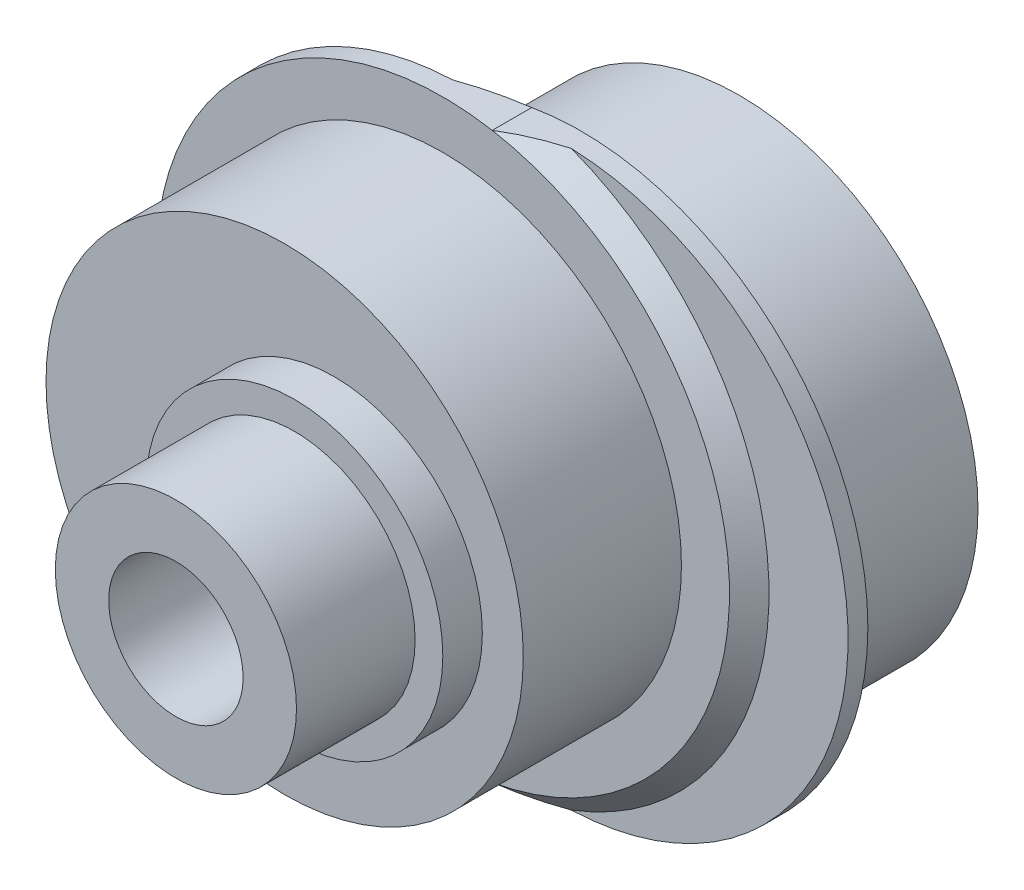
ISO-10303-21;
HEADER;
FILE_DESCRIPTION(('STEP AP214'),'2;1');
FILE_NAME('part.step','',(''),(''),'','','');
FILE_SCHEMA(('AUTOMOTIVE_DESIGN { 1 0 10303 214 1 1 1 1 }'));
ENDSEC;
DATA;
#1=APPLICATION_CONTEXT('core data for automotive mechanical design processes');
#2=APPLICATION_PROTOCOL_DEFINITION('international standard','automotive_design',2000,#1);
#3=PRODUCT_CONTEXT('',#1,'mechanical');
#4=PRODUCT('Part','Part','',(#3));
#5=PRODUCT_RELATED_PRODUCT_CATEGORY('part','',(#4));
#6=PRODUCT_DEFINITION_FORMATION('','',#4);
#7=PRODUCT_DEFINITION_CONTEXT('part definition',#1,'design');
#8=PRODUCT_DEFINITION('design','',#6,#7);
#9=PRODUCT_DEFINITION_SHAPE('','',#8);
#10=(LENGTH_UNIT() NAMED_UNIT(*) SI_UNIT(.MILLI.,.METRE.));
#11=(NAMED_UNIT(*) PLANE_ANGLE_UNIT() SI_UNIT($,.RADIAN.));
#12=(NAMED_UNIT(*) SI_UNIT($,.STERADIAN.) SOLID_ANGLE_UNIT());
#13=UNCERTAINTY_MEASURE_WITH_UNIT(LENGTH_MEASURE(1.E-05),#10,'distance_accuracy_value','');
#14=(GEOMETRIC_REPRESENTATION_CONTEXT(3) GLOBAL_UNCERTAINTY_ASSIGNED_CONTEXT((#13)) GLOBAL_UNIT_ASSIGNED_CONTEXT((#10,
#11,#12)) REPRESENTATION_CONTEXT('',''));
#15=CARTESIAN_POINT('',(0.,0.,0.));
#16=DIRECTION('',(0.,0.,1.));
#17=DIRECTION('',(1.,0.,0.));
#18=AXIS2_PLACEMENT_3D('',#15,#16,#17);
#19=CARTESIAN_POINT('',(0.,0.,5.));
#20=DIRECTION('',(0.,0.,1.));
#21=DIRECTION('',(1.,0.,0.));
#22=AXIS2_PLACEMENT_3D('',#19,#20,#21);
#23=PLANE('',#22);
#24=CARTESIAN_POINT('',(-1.25,0.,5.));
#25=DIRECTION('',(0.,0.,1.));
#26=DIRECTION('',(1.,0.,0.));
#27=AXIS2_PLACEMENT_3D('',#24,#25,#26);
#28=CIRCLE('',#27,6.035);
#29=CARTESIAN_POINT('',(4.785,0.,5.));
#30=VERTEX_POINT('',#29);
#31=EDGE_CURVE('E285',#30,#30,#28,.T.);
#32=ORIENTED_EDGE('',*,*,#31,.F.);
#33=EDGE_LOOP('',(#32));
#34=FACE_BOUND('',#33,.T.);
#35=CARTESIAN_POINT('',(-1.25,0.,5.));
#36=DIRECTION('',(0.,0.,1.));
#37=DIRECTION('',(1.,0.,0.));
#38=AXIS2_PLACEMENT_3D('',#35,#36,#37);
#39=CIRCLE('',#38,7.25);
#40=CARTESIAN_POINT('',(0.,-7.14142842854285,5.));
#41=VERTEX_POINT('',#40);
#42=CARTESIAN_POINT('',(0.,7.14142842854285,5.));
#43=VERTEX_POINT('',#42);
#44=EDGE_CURVE('E512',#41,#43,#39,.F.);
#45=ORIENTED_EDGE('',*,*,#44,.F.);
#46=EDGE_CURVE('E508',#43,#41,#39,.F.);
#47=ORIENTED_EDGE('',*,*,#46,.F.);
#48=EDGE_LOOP('',(#45,#47));
#49=FACE_BOUND('',#48,.T.);
#50=ADVANCED_FACE('F51',(#34,#49),#23,.T.);
#51=CARTESIAN_POINT('',(1.25,0.,5.002));
#52=DIRECTION('',(0.,0.,-1.));
#53=DIRECTION('',(-1.,0.,0.));
#54=AXIS2_PLACEMENT_3D('',#51,#52,#53);
#55=CYLINDRICAL_SURFACE('',#54,7.25);
#56=DIRECTION('',(0.,0.,-1.));
#57=VECTOR('',#56,1.);
#58=CARTESIAN_POINT('',(0.,-7.14142842854286,4.5));
#59=LINE('',#58,#57);
#60=CARTESIAN_POINT('',(0.,-7.14142842854285,4.));
#61=VERTEX_POINT('',#60);
#62=EDGE_CURVE('E435',#61,#41,#59,.F.);
#63=ORIENTED_EDGE('',*,*,#62,.F.);
#64=CARTESIAN_POINT('',(1.25,0.,4.));
#65=DIRECTION('',(0.,0.,1.));
#66=DIRECTION('',(1.,0.,0.));
#67=AXIS2_PLACEMENT_3D('',#64,#65,#66);
#68=CIRCLE('',#67,7.25);
#69=CARTESIAN_POINT('',(0.,7.14142842854285,4.));
#70=VERTEX_POINT('',#69);
#71=EDGE_CURVE('E433',#61,#70,#68,.T.);
#72=ORIENTED_EDGE('',*,*,#71,.T.);
#73=DIRECTION('',(0.,0.,-1.));
#74=VECTOR('',#73,1.);
#75=CARTESIAN_POINT('',(0.,7.14142842854285,5.));
#76=LINE('',#75,#74);
#77=EDGE_CURVE('E434',#43,#70,#76,.T.);
#78=ORIENTED_EDGE('',*,*,#77,.F.);
#79=CARTESIAN_POINT('',(0.,7.14142842854285,5.));
#80=CARTESIAN_POINT('',(0.123509212670828,7.16304891105433,4.95740968363325));
#81=CARTESIAN_POINT('',(0.247635722677284,7.18147105171403,4.91498366677334));
#82=CARTESIAN_POINT('',(0.49651091045968,7.21182527272824,4.83064523991889));
#83=CARTESIAN_POINT('',(0.621257332919159,7.22377306991179,4.78873182975381));
#84=CARTESIAN_POINT('',(0.871367149572558,7.24119131188943,4.7053944927514));
#85=CARTESIAN_POINT('',(0.996730552877659,7.24666166073876,4.66397057317345));
#86=CARTESIAN_POINT('',(1.24806465393637,7.25109232554975,4.58158902108588));
#87=CARTESIAN_POINT('',(1.37403608710189,7.25003669470633,4.54063277598186));
#88=CARTESIAN_POINT('',(1.5,7.24568837309472,4.5));
#89=B_SPLINE_CURVE_WITH_KNOTS('',3,(#79,#80,#81,#82,#83,#84,#85,#86,#87,#88),.UNSPECIFIED.,.F.,
.F.,(4,2,2,2,4),(0.,0.397230594114684,0.793492519067464,1.18976031342777,1.58699680509372),.UNSPECIFIED.);
#90=CARTESIAN_POINT('',(1.5,7.24568837309472,4.5));
#91=VERTEX_POINT('',#90);
#92=EDGE_CURVE('E344',#43,#91,#89,.T.);
#93=ORIENTED_EDGE('',*,*,#92,.T.);
#94=CARTESIAN_POINT('',(1.25,0.,4.5));
#95=DIRECTION('',(0.,0.,1.));
#96=DIRECTION('',(1.,0.,0.));
#97=AXIS2_PLACEMENT_3D('',#94,#95,#96);
#98=CIRCLE('',#97,7.25);
#99=CARTESIAN_POINT('',(1.5,-7.24568837309472,4.5));
#100=VERTEX_POINT('',#99);
#101=EDGE_CURVE('E360',#100,#91,#98,.T.);
#102=ORIENTED_EDGE('',*,*,#101,.F.);
#103=CARTESIAN_POINT('',(1.5,-7.24568837309472,4.5));
#104=CARTESIAN_POINT('',(1.37403608710189,-7.25003669470633,4.54063277598186));
#105=CARTESIAN_POINT('',(1.24806465393637,-7.25109232554975,4.58158902108588));
#106=CARTESIAN_POINT('',(0.996730552877659,-7.24666166073876,4.66397057317345));
#107=CARTESIAN_POINT('',(0.871367149572559,-7.24119131188943,4.7053944927514));
#108=CARTESIAN_POINT('',(0.621257332919159,-7.22377306991179,4.78873182975381));
#109=CARTESIAN_POINT('',(0.49651091045968,-7.21182527272824,4.83064523991889));
#110=CARTESIAN_POINT('',(0.247635722677285,-7.18147105171403,4.91498366677334));
#111=CARTESIAN_POINT('',(0.123509212670829,-7.16304891105433,4.95740968363325));
#112=CARTESIAN_POINT('',(0.,-7.14142842854285,5.));
#113=B_SPLINE_CURVE_WITH_KNOTS('',3,(#103,#104,#105,#106,#107,#108,#109,#110,#111,#112),
.UNSPECIFIED.,.F.,.F.,(4,2,2,2,4),(0.,0.397236491665957,0.793504286026259,1.18976621097904,
1.58699680509372),.UNSPECIFIED.);
#114=EDGE_CURVE('E353',#100,#41,#113,.T.);
#115=ORIENTED_EDGE('',*,*,#114,.T.);
#116=EDGE_LOOP('',(#63,#72,#78,#93,#102,#115));
#117=FACE_BOUND('',#116,.T.);
#118=ADVANCED_FACE('F332',(#117),#55,.T.);
#119=CARTESIAN_POINT('',(0.,0.,4.));
#120=DIRECTION('',(0.,0.,1.));
#121=DIRECTION('',(1.,0.,0.));
#122=AXIS2_PLACEMENT_3D('',#119,#120,#121);
#123=PLANE('',#122);
#124=CARTESIAN_POINT('',(1.25,0.,4.));
#125=DIRECTION('',(0.,0.,1.));
#126=DIRECTION('',(1.,0.,0.));
#127=AXIS2_PLACEMENT_3D('',#124,#125,#126);
#128=CIRCLE('',#127,6.035);
#129=CARTESIAN_POINT('',(7.285,0.,4.));
#130=VERTEX_POINT('',#129);
#131=EDGE_CURVE('E513',#130,#130,#128,.F.);
#132=ORIENTED_EDGE('',*,*,#131,.F.);
#133=EDGE_LOOP('',(#132));
#134=FACE_BOUND('',#133,.T.);
#135=EDGE_CURVE('E361',#70,#61,#68,.T.);
#136=ORIENTED_EDGE('',*,*,#135,.F.);
#137=ORIENTED_EDGE('',*,*,#71,.F.);
#138=EDGE_LOOP('',(#136,#137));
#139=FACE_BOUND('',#138,.T.);
#140=ADVANCED_FACE('F327',(#134,#139),#123,.F.);
#141=CARTESIAN_POINT('',(-1.25,0.,5.002));
#142=DIRECTION('',(0.,0.,-1.));
#143=DIRECTION('',(-1.,0.,0.));
#144=AXIS2_PLACEMENT_3D('',#141,#142,#143);
#145=CYLINDRICAL_SURFACE('',#144,7.25);
#146=CARTESIAN_POINT('',(-1.25,0.,4.5));
#147=DIRECTION('',(0.,0.,-1.));
#148=DIRECTION('',(1.,0.,0.));
#149=AXIS2_PLACEMENT_3D('',#146,#147,#148);
#150=CIRCLE('',#149,7.25);
#151=CARTESIAN_POINT('',(-1.49999999999996,-7.24568837309473,4.5));
#152=VERTEX_POINT('',#151);
#153=CARTESIAN_POINT('',(-1.50000000000003,7.24568837309471,4.5));
#154=VERTEX_POINT('',#153);
#155=EDGE_CURVE('E362',#152,#154,#150,.T.);
#156=ORIENTED_EDGE('',*,*,#155,.F.);
#157=CARTESIAN_POINT('',(-1.49999999999996,-7.24568837309473,4.5));
#158=CARTESIAN_POINT('',(-1.37403608710186,-7.25003669470634,4.45936722401813));
#159=CARTESIAN_POINT('',(-1.24806465393634,-7.25109232554975,4.41841097891411));
#160=CARTESIAN_POINT('',(-0.996730552877636,-7.24666166073876,4.33602942682654));
#161=CARTESIAN_POINT('',(-0.871367149572538,-7.24119131188943,4.2946055072486));
#162=CARTESIAN_POINT('',(-0.621257332919143,-7.22377306991179,4.21126817024618));
#163=CARTESIAN_POINT('',(-0.496510910459668,-7.21182527272824,4.1693547600811));
#164=CARTESIAN_POINT('',(-0.247635722677277,-7.18147105171403,4.08501633322665));
#165=CARTESIAN_POINT('',(-0.123509212670824,-7.16304891105433,4.04259031636675));
#166=CARTESIAN_POINT('',(0.,-7.14142842854285,4.));
#167=B_SPLINE_CURVE_WITH_KNOTS('',3,(#157,#158,#159,#160,#161,#162,#163,#164,#165,#166),
.UNSPECIFIED.,.F.,.F.,(4,2,2,2,4),(0.,0.397236491665947,0.793504286026242,1.18976621097901,
1.58699680509369),.UNSPECIFIED.);
#168=EDGE_CURVE('E311',#152,#61,#167,.T.);
#169=ORIENTED_EDGE('',*,*,#168,.T.);
#170=ORIENTED_EDGE('',*,*,#62,.T.);
#171=ORIENTED_EDGE('',*,*,#44,.T.);
#172=ORIENTED_EDGE('',*,*,#77,.T.);
#173=CARTESIAN_POINT('',(0.,7.14142842854285,4.));
#174=CARTESIAN_POINT('',(-0.123509212670831,7.16304891105433,4.04259031636675));
#175=CARTESIAN_POINT('',(-0.24763572267729,7.18147105171404,4.08501633322666));
#176=CARTESIAN_POINT('',(-0.49651091045969,7.21182527272825,4.16935476008111));
#177=CARTESIAN_POINT('',(-0.62125733291917,7.22377306991179,4.21126817024619));
#178=CARTESIAN_POINT('',(-0.871367149572574,7.24119131188943,4.29460550724861));
#179=CARTESIAN_POINT('',(-0.996730552877677,7.24666166073876,4.33602942682656));
#180=CARTESIAN_POINT('',(-1.24806465393639,7.25109232554975,4.41841097891412));
#181=CARTESIAN_POINT('',(-1.37403608710192,7.25003669470633,4.45936722401814));
#182=CARTESIAN_POINT('',(-1.50000000000003,7.24568837309472,4.5));
#183=B_SPLINE_CURVE_WITH_KNOTS('',3,(#173,#174,#175,#176,#177,#178,#179,#180,#181,#182),
.UNSPECIFIED.,.F.,.F.,(4,2,2,2,4),(0.,0.397230594114692,0.793492519067479,1.18976031342779,
1.58699680509375),.UNSPECIFIED.);
#184=EDGE_CURVE('E301',#70,#154,#183,.T.);
#185=ORIENTED_EDGE('',*,*,#184,.T.);
#186=EDGE_LOOP('',(#156,#169,#170,#171,#172,#185));
#187=FACE_BOUND('',#186,.T.);
#188=ADVANCED_FACE('F322',(#187),#145,.T.);
#189=CARTESIAN_POINT('',(0.,0.,4.5));
#190=DIRECTION('',(0.,0.,1.));
#191=DIRECTION('',(1.,0.,0.));
#192=AXIS2_PLACEMENT_3D('',#189,#190,#191);
#193=PLANE('',#192);
#194=ORIENTED_EDGE('',*,*,#101,.T.);
#195=CARTESIAN_POINT('',(-1.25,0.,4.5));
#196=DIRECTION('',(0.,0.,1.));
#197=DIRECTION('',(1.,0.,0.));
#198=AXIS2_PLACEMENT_3D('',#195,#196,#197);
#199=CIRCLE('',#198,7.75);
#200=EDGE_CURVE('E297',#91,#100,#199,.F.);
#201=ORIENTED_EDGE('',*,*,#200,.T.);
#202=EDGE_LOOP('',(#194,#201));
#203=FACE_BOUND('',#202,.T.);
#204=ADVANCED_FACE('F326',(#203),#193,.T.);
#205=CARTESIAN_POINT('',(0.,0.,4.5));
#206=DIRECTION('',(0.,0.,1.));
#207=DIRECTION('',(1.,0.,0.));
#208=AXIS2_PLACEMENT_3D('',#205,#206,#207);
#209=PLANE('',#208);
#210=ORIENTED_EDGE('',*,*,#155,.T.);
#211=CARTESIAN_POINT('',(1.25,0.,4.5));
#212=DIRECTION('',(0.,0.,1.));
#213=DIRECTION('',(1.,0.,0.));
#214=AXIS2_PLACEMENT_3D('',#211,#212,#213);
#215=CIRCLE('',#214,7.75);
#216=EDGE_CURVE('E290',#154,#152,#215,.T.);
#217=ORIENTED_EDGE('',*,*,#216,.T.);
#218=EDGE_LOOP('',(#210,#217));
#219=FACE_BOUND('',#218,.T.);
#220=ADVANCED_FACE('F338',(#219),#209,.F.);
#221=CARTESIAN_POINT('',(-1.25,0.,4.5));
#222=DIRECTION('',(0.,0.,-1.));
#223=DIRECTION('',(-1.,0.,0.));
#224=AXIS2_PLACEMENT_3D('',#221,#222,#223);
#225=CONICAL_SURFACE('',#224,7.75,0.785398163397448);
#226=ORIENTED_EDGE('',*,*,#92,.F.);
#227=ORIENTED_EDGE('',*,*,#46,.T.);
#228=ORIENTED_EDGE('',*,*,#114,.F.);
#229=ORIENTED_EDGE('',*,*,#200,.F.);
#230=EDGE_LOOP('',(#226,#227,#228,#229));
#231=FACE_BOUND('',#230,.T.);
#232=ADVANCED_FACE('F334',(#231),#225,.T.);
#233=CARTESIAN_POINT('',(1.25,0.,4.5));
#234=DIRECTION('',(0.,0.,1.));
#235=DIRECTION('',(1.,0.,0.));
#236=AXIS2_PLACEMENT_3D('',#233,#234,#235);
#237=CONICAL_SURFACE('',#236,7.75,0.785398163397448);
#238=ORIENTED_EDGE('',*,*,#184,.F.);
#239=ORIENTED_EDGE('',*,*,#135,.T.);
#240=ORIENTED_EDGE('',*,*,#168,.F.);
#241=ORIENTED_EDGE('',*,*,#216,.F.);
#242=EDGE_LOOP('',(#238,#239,#240,#241));
#243=FACE_BOUND('',#242,.T.);
#244=ADVANCED_FACE('F319',(#243),#237,.T.);
#245=CARTESIAN_POINT('',(-1.25,0.,9.));
#246=DIRECTION('',(0.,0.,-1.));
#247=DIRECTION('',(-1.,0.,0.));
#248=AXIS2_PLACEMENT_3D('',#245,#246,#247);
#249=CYLINDRICAL_SURFACE('',#248,6.035);
#250=CARTESIAN_POINT('',(-1.25,0.,9.));
#251=DIRECTION('',(0.,0.,1.));
#252=DIRECTION('',(1.,0.,0.));
#253=AXIS2_PLACEMENT_3D('',#250,#251,#252);
#254=CIRCLE('',#253,6.035);
#255=CARTESIAN_POINT('',(4.785,0.,9.));
#256=VERTEX_POINT('',#255);
#257=EDGE_CURVE('E286',#256,#256,#254,.T.);
#258=ORIENTED_EDGE('',*,*,#257,.F.);
#259=EDGE_LOOP('',(#258));
#260=FACE_BOUND('',#259,.T.);
#261=ORIENTED_EDGE('',*,*,#31,.T.);
#262=EDGE_LOOP('',(#261));
#263=FACE_BOUND('',#262,.T.);
#264=ADVANCED_FACE('F678',(#260,#263),#249,.T.);
#265=CARTESIAN_POINT('',(-1.25,0.,9.));
#266=DIRECTION('',(0.,0.,1.));
#267=DIRECTION('',(1.,0.,0.));
#268=AXIS2_PLACEMENT_3D('',#265,#266,#267);
#269=PLANE('',#268);
#270=CARTESIAN_POINT('',(0.,0.,9.));
#271=DIRECTION('',(0.,0.,-1.));
#272=DIRECTION('',(-1.,0.,0.));
#273=AXIS2_PLACEMENT_3D('',#270,#271,#272);
#274=CIRCLE('',#273,3.75);
#275=CARTESIAN_POINT('',(-3.75,0.,9.));
#276=VERTEX_POINT('',#275);
#277=EDGE_CURVE('E981',#276,#276,#274,.T.);
#278=ORIENTED_EDGE('',*,*,#277,.T.);
#279=EDGE_LOOP('',(#278));
#280=FACE_BOUND('',#279,.T.);
#281=ORIENTED_EDGE('',*,*,#257,.T.);
#282=EDGE_LOOP('',(#281));
#283=FACE_BOUND('',#282,.T.);
#284=ADVANCED_FACE('F672',(#280,#283),#269,.T.);
#285=CARTESIAN_POINT('',(1.25,0.,0.));
#286=DIRECTION('',(0.,0.,1.));
#287=DIRECTION('',(1.,0.,0.));
#288=AXIS2_PLACEMENT_3D('',#285,#286,#287);
#289=CYLINDRICAL_SURFACE('',#288,6.035);
#290=CARTESIAN_POINT('',(1.25,0.,0.));
#291=DIRECTION('',(0.,0.,-1.));
#292=DIRECTION('',(-1.,0.,0.));
#293=AXIS2_PLACEMENT_3D('',#290,#291,#292);
#294=CIRCLE('',#293,6.035);
#295=CARTESIAN_POINT('',(-4.785,0.,0.));
#296=VERTEX_POINT('',#295);
#297=EDGE_CURVE('E261',#296,#296,#294,.T.);
#298=ORIENTED_EDGE('',*,*,#297,.F.);
#299=EDGE_LOOP('',(#298));
#300=FACE_BOUND('',#299,.T.);
#301=ORIENTED_EDGE('',*,*,#131,.T.);
#302=EDGE_LOOP('',(#301));
#303=FACE_BOUND('',#302,.T.);
#304=ADVANCED_FACE('F677',(#300,#303),#289,.T.);
#305=CARTESIAN_POINT('',(1.25,0.,0.));
#306=DIRECTION('',(0.,0.,-1.));
#307=DIRECTION('',(-1.,0.,0.));
#308=AXIS2_PLACEMENT_3D('',#305,#306,#307);
#309=PLANE('',#308);
#310=DIRECTION('',(0.,-1.,0.));
#311=VECTOR('',#310,1.);
#312=CARTESIAN_POINT('',(6.,1.73205080756887,0.));
#313=LINE('',#312,#311);
#314=CARTESIAN_POINT('',(6.,2.23205080756888,0.));
#315=VERTEX_POINT('',#314);
#316=CARTESIAN_POINT('',(6.,-2.23205080756888,0.));
#317=VERTEX_POINT('',#316);
#318=EDGE_CURVE('E215',#315,#317,#313,.T.);
#319=ORIENTED_EDGE('',*,*,#318,.F.);
#320=DIRECTION('',(-1.,0.,0.));
#321=VECTOR('',#320,1.);
#322=CARTESIAN_POINT('',(3.16000000000001,2.23205080756888,0.));
#323=LINE('',#322,#321);
#324=CARTESIAN_POINT('',(2.29397459621557,2.23205080756888,0.));
#325=VERTEX_POINT('',#324);
#326=EDGE_CURVE('E531',#315,#325,#323,.T.);
#327=ORIENTED_EDGE('',*,*,#326,.T.);
#328=DIRECTION('',(0.866025403784439,-0.499999999999999,0.));
#329=VECTOR('',#328,1.);
#330=CARTESIAN_POINT('',(0.,3.55647765820809,0.));
#331=LINE('',#330,#329);
#332=CARTESIAN_POINT('',(0.,3.55647765820809,0.));
#333=VERTEX_POINT('',#332);
#334=EDGE_CURVE('E222',#333,#325,#331,.T.);
#335=ORIENTED_EDGE('',*,*,#334,.F.);
#336=DIRECTION('',(0.866025403784439,0.499999999999999,0.));
#337=VECTOR('',#336,1.);
#338=CARTESIAN_POINT('',(-3.08,1.77823882910405,0.));
#339=LINE('',#338,#337);
#340=CARTESIAN_POINT('',(-3.08,1.77823882910405,0.));
#341=VERTEX_POINT('',#340);
#342=EDGE_CURVE('E250',#341,#333,#339,.T.);
#343=ORIENTED_EDGE('',*,*,#342,.F.);
#344=DIRECTION('',(0.,1.,0.));
#345=VECTOR('',#344,1.);
#346=CARTESIAN_POINT('',(-3.08,-1.77823882910405,0.));
#347=LINE('',#346,#345);
#348=CARTESIAN_POINT('',(-3.08,-1.77823882910405,0.));
#349=VERTEX_POINT('',#348);
#350=EDGE_CURVE('E246',#349,#341,#347,.T.);
#351=ORIENTED_EDGE('',*,*,#350,.F.);
#352=DIRECTION('',(-0.866025403784438,0.500000000000001,0.));
#353=VECTOR('',#352,1.);
#354=CARTESIAN_POINT('',(0.,-3.55647765820809,0.));
#355=LINE('',#354,#353);
#356=CARTESIAN_POINT('',(0.,-3.55647765820809,0.));
#357=VERTEX_POINT('',#356);
#358=EDGE_CURVE('E242',#357,#349,#355,.T.);
#359=ORIENTED_EDGE('',*,*,#358,.F.);
#360=DIRECTION('',(-0.866025403784438,-0.5,0.));
#361=VECTOR('',#360,1.);
#362=CARTESIAN_POINT('',(3.15999999999999,-1.73205080756888,0.));
#363=LINE('',#362,#361);
#364=CARTESIAN_POINT('',(2.29397459621555,-2.23205080756888,0.));
#365=VERTEX_POINT('',#364);
#366=EDGE_CURVE('E239',#365,#357,#363,.T.);
#367=ORIENTED_EDGE('',*,*,#366,.F.);
#368=DIRECTION('',(1.,0.,0.));
#369=VECTOR('',#368,1.);
#370=CARTESIAN_POINT('',(6.,-2.23205080756888,0.));
#371=LINE('',#370,#369);
#372=EDGE_CURVE('E527',#365,#317,#371,.T.);
#373=ORIENTED_EDGE('',*,*,#372,.T.);
#374=EDGE_LOOP('',(#319,#327,#335,#343,#351,#359,#367,#373));
#375=FACE_BOUND('',#374,.T.);
#376=ORIENTED_EDGE('',*,*,#297,.T.);
#377=EDGE_LOOP('',(#376));
#378=FACE_BOUND('',#377,.T.);
#379=ADVANCED_FACE('F552',(#375,#378),#309,.T.);
#380=CARTESIAN_POINT('',(6.,1.73205080756887,2.));
#381=DIRECTION('',(1.,0.,0.));
#382=DIRECTION('',(0.,1.,0.));
#383=AXIS2_PLACEMENT_3D('',#380,#381,#382);
#384=PLANE('',#383);
#385=ORIENTED_EDGE('',*,*,#318,.T.);
#386=DIRECTION('',(0.,0.707106781186548,0.707106781186548));
#387=VECTOR('',#386,1.);
#388=CARTESIAN_POINT('',(6.,0.749999999999998,2.98205080756888));
#389=LINE('',#388,#387);
#390=CARTESIAN_POINT('',(6.,-1.73205080756888,0.5));
#391=VERTEX_POINT('',#390);
#392=EDGE_CURVE('E12',#317,#391,#389,.T.);
#393=ORIENTED_EDGE('',*,*,#392,.T.);
#394=DIRECTION('',(0.,0.,-1.));
#395=VECTOR('',#394,1.);
#396=CARTESIAN_POINT('',(6.,-1.73205080756888,2.));
#397=LINE('',#396,#395);
#398=CARTESIAN_POINT('',(6.,-1.73205080756888,2.));
#399=VERTEX_POINT('',#398);
#400=EDGE_CURVE('E236',#399,#391,#397,.T.);
#401=ORIENTED_EDGE('',*,*,#400,.F.);
#402=DIRECTION('',(0.,-1.,0.));
#403=VECTOR('',#402,1.);
#404=CARTESIAN_POINT('',(6.,1.73205080756887,2.));
#405=LINE('',#404,#403);
#406=CARTESIAN_POINT('',(6.,1.73205080756887,2.));
#407=VERTEX_POINT('',#406);
#408=EDGE_CURVE('E217',#407,#399,#405,.T.);
#409=ORIENTED_EDGE('',*,*,#408,.F.);
#410=DIRECTION('',(0.,0.,-1.));
#411=VECTOR('',#410,1.);
#412=CARTESIAN_POINT('',(6.,1.73205080756887,2.));
#413=LINE('',#412,#411);
#414=CARTESIAN_POINT('',(6.,1.73205080756887,0.5));
#415=VERTEX_POINT('',#414);
#416=EDGE_CURVE('E257',#407,#415,#413,.T.);
#417=ORIENTED_EDGE('',*,*,#416,.T.);
#418=DIRECTION('',(0.,0.707106781186548,-0.707106781186547));
#419=VECTOR('',#418,1.);
#420=CARTESIAN_POINT('',(6.,0.982050807568875,1.25));
#421=LINE('',#420,#419);
#422=EDGE_CURVE('E61',#415,#315,#421,.T.);
#423=ORIENTED_EDGE('',*,*,#422,.T.);
#424=EDGE_LOOP('',(#385,#393,#401,#409,#417,#423));
#425=FACE_BOUND('',#424,.T.);
#426=ADVANCED_FACE('F544',(#425),#384,.F.);
#427=CARTESIAN_POINT('',(3.16000000000001,1.73205080756887,2.));
#428=DIRECTION('',(0.,1.,0.));
#429=DIRECTION('',(0.,0.,1.));
#430=AXIS2_PLACEMENT_3D('',#427,#428,#429);
#431=PLANE('',#430);
#432=DIRECTION('',(0.,0.,-1.));
#433=VECTOR('',#432,1.);
#434=CARTESIAN_POINT('',(3.16000000000001,1.73205080756887,2.));
#435=LINE('',#434,#433);
#436=CARTESIAN_POINT('',(3.16000000000001,1.73205080756887,2.));
#437=VERTEX_POINT('',#436);
#438=CARTESIAN_POINT('',(3.16000000000001,1.73205080756887,0.5));
#439=VERTEX_POINT('',#438);
#440=EDGE_CURVE('E262',#437,#439,#435,.T.);
#441=ORIENTED_EDGE('',*,*,#440,.T.);
#442=DIRECTION('',(1.,0.,0.));
#443=VECTOR('',#442,1.);
#444=CARTESIAN_POINT('',(6.,1.73205080756887,0.5));
#445=LINE('',#444,#443);
#446=EDGE_CURVE('E517',#439,#415,#445,.T.);
#447=ORIENTED_EDGE('',*,*,#446,.T.);
#448=ORIENTED_EDGE('',*,*,#416,.F.);
#449=DIRECTION('',(1.,0.,0.));
#450=VECTOR('',#449,1.);
#451=CARTESIAN_POINT('',(3.16000000000001,1.73205080756887,2.));
#452=LINE('',#451,#450);
#453=EDGE_CURVE('E232',#437,#407,#452,.T.);
#454=ORIENTED_EDGE('',*,*,#453,.F.);
#455=EDGE_LOOP('',(#441,#447,#448,#454));
#456=FACE_BOUND('',#455,.T.);
#457=ADVANCED_FACE('F626',(#456),#431,.F.);
#458=CARTESIAN_POINT('',(0.,3.55647765820809,2.));
#459=DIRECTION('',(0.499999999999999,0.866025403784439,0.));
#460=DIRECTION('',(-0.866025403784439,0.5,0.));
#461=AXIS2_PLACEMENT_3D('',#458,#459,#460);
#462=PLANE('',#461);
#463=ORIENTED_EDGE('',*,*,#334,.T.);
#464=DIRECTION('',(0.774596669241484,-0.447213595499958,0.447213595499957));
#465=VECTOR('',#464,1.);
#466=CARTESIAN_POINT('',(3.16000000000001,1.73205080756887,0.5));
#467=LINE('',#466,#465);
#468=EDGE_CURVE('E534',#325,#439,#467,.T.);
#469=ORIENTED_EDGE('',*,*,#468,.T.);
#470=ORIENTED_EDGE('',*,*,#440,.F.);
#471=DIRECTION('',(0.866025403784439,-0.499999999999999,0.));
#472=VECTOR('',#471,1.);
#473=CARTESIAN_POINT('',(0.,3.55647765820809,2.));
#474=LINE('',#473,#472);
#475=CARTESIAN_POINT('',(3.08,1.77823882910405,2.));
#476=VERTEX_POINT('',#475);
#477=EDGE_CURVE('E229',#476,#437,#474,.T.);
#478=ORIENTED_EDGE('',*,*,#477,.F.);
#479=DIRECTION('',(0.,0.,-1.));
#480=VECTOR('',#479,1.);
#481=CARTESIAN_POINT('',(3.08,1.77823882910405,7.5));
#482=LINE('',#481,#480);
#483=CARTESIAN_POINT('',(3.08,1.77823882910405,7.5));
#484=VERTEX_POINT('',#483);
#485=EDGE_CURVE('E177',#484,#476,#482,.T.);
#486=ORIENTED_EDGE('',*,*,#485,.F.);
#487=DIRECTION('',(0.866025403784438,-0.500000000000001,0.));
#488=VECTOR('',#487,1.);
#489=CARTESIAN_POINT('',(0.,3.55647765820809,7.5));
#490=LINE('',#489,#488);
#491=CARTESIAN_POINT('',(0.,3.55647765820809,7.5));
#492=VERTEX_POINT('',#491);
#493=EDGE_CURVE('E178',#492,#484,#490,.T.);
#494=ORIENTED_EDGE('',*,*,#493,.F.);
#495=DIRECTION('',(0.,0.,-1.));
#496=VECTOR('',#495,1.);
#497=CARTESIAN_POINT('',(0.,3.55647765820809,2.));
#498=LINE('',#497,#496);
#499=EDGE_CURVE('E266',#492,#333,#498,.T.);
#500=ORIENTED_EDGE('',*,*,#499,.T.);
#501=EDGE_LOOP('',(#463,#469,#470,#478,#486,#494,#500));
#502=FACE_BOUND('',#501,.T.);
#503=ADVANCED_FACE('F556',(#502),#462,.F.);
#504=CARTESIAN_POINT('',(-3.08,1.77823882910405,2.));
#505=DIRECTION('',(-0.5,0.866025403784439,0.));
#506=DIRECTION('',(-0.866025403784439,-0.499999999999999,0.));
#507=AXIS2_PLACEMENT_3D('',#504,#505,#506);
#508=PLANE('',#507);
#509=ORIENTED_EDGE('',*,*,#342,.T.);
#510=ORIENTED_EDGE('',*,*,#499,.F.);
#511=DIRECTION('',(0.866025403784439,0.499999999999999,0.));
#512=VECTOR('',#511,1.);
#513=CARTESIAN_POINT('',(-3.08,1.77823882910405,7.5));
#514=LINE('',#513,#512);
#515=CARTESIAN_POINT('',(-3.08,1.77823882910405,7.5));
#516=VERTEX_POINT('',#515);
#517=EDGE_CURVE('E209',#516,#492,#514,.T.);
#518=ORIENTED_EDGE('',*,*,#517,.F.);
#519=DIRECTION('',(0.,0.,-1.));
#520=VECTOR('',#519,1.);
#521=CARTESIAN_POINT('',(-3.08,1.77823882910405,2.));
#522=LINE('',#521,#520);
#523=EDGE_CURVE('E269',#516,#341,#522,.T.);
#524=ORIENTED_EDGE('',*,*,#523,.T.);
#525=EDGE_LOOP('',(#509,#510,#518,#524));
#526=FACE_BOUND('',#525,.T.);
#527=ADVANCED_FACE('F560',(#526),#508,.F.);
#528=CARTESIAN_POINT('',(-3.08,-1.77823882910405,2.));
#529=DIRECTION('',(-1.,0.,0.));
#530=DIRECTION('',(0.,0.,1.));
#531=AXIS2_PLACEMENT_3D('',#528,#529,#530);
#532=PLANE('',#531);
#533=ORIENTED_EDGE('',*,*,#350,.T.);
#534=ORIENTED_EDGE('',*,*,#523,.F.);
#535=DIRECTION('',(0.,1.,0.));
#536=VECTOR('',#535,1.);
#537=CARTESIAN_POINT('',(-3.08,-1.77823882910405,7.5));
#538=LINE('',#537,#536);
#539=CARTESIAN_POINT('',(-3.08,-1.77823882910405,7.5));
#540=VERTEX_POINT('',#539);
#541=EDGE_CURVE('E205',#540,#516,#538,.T.);
#542=ORIENTED_EDGE('',*,*,#541,.F.);
#543=DIRECTION('',(0.,0.,-1.));
#544=VECTOR('',#543,1.);
#545=CARTESIAN_POINT('',(-3.08,-1.77823882910405,2.));
#546=LINE('',#545,#544);
#547=EDGE_CURVE('E272',#540,#349,#546,.T.);
#548=ORIENTED_EDGE('',*,*,#547,.T.);
#549=EDGE_LOOP('',(#533,#534,#542,#548));
#550=FACE_BOUND('',#549,.T.);
#551=ADVANCED_FACE('F565',(#550),#532,.F.);
#552=CARTESIAN_POINT('',(0.,-3.55647765820809,2.));
#553=DIRECTION('',(-0.500000000000001,-0.866025403784438,0.));
#554=DIRECTION('',(0.866025403784438,-0.500000000000001,0.));
#555=AXIS2_PLACEMENT_3D('',#552,#553,#554);
#556=PLANE('',#555);
#557=ORIENTED_EDGE('',*,*,#358,.T.);
#558=ORIENTED_EDGE('',*,*,#547,.F.);
#559=DIRECTION('',(-0.866025403784438,0.500000000000001,0.));
#560=VECTOR('',#559,1.);
#561=CARTESIAN_POINT('',(0.,-3.55647765820809,7.5));
#562=LINE('',#561,#560);
#563=CARTESIAN_POINT('',(0.,-3.55647765820809,7.5));
#564=VERTEX_POINT('',#563);
#565=EDGE_CURVE('E190',#564,#540,#562,.T.);
#566=ORIENTED_EDGE('',*,*,#565,.F.);
#567=DIRECTION('',(0.,0.,-1.));
#568=VECTOR('',#567,1.);
#569=CARTESIAN_POINT('',(0.,-3.55647765820809,2.));
#570=LINE('',#569,#568);
#571=EDGE_CURVE('E185',#564,#357,#570,.T.);
#572=ORIENTED_EDGE('',*,*,#571,.T.);
#573=EDGE_LOOP('',(#557,#558,#566,#572));
#574=FACE_BOUND('',#573,.T.);
#575=ADVANCED_FACE('F568',(#574),#556,.F.);
#576=CARTESIAN_POINT('',(3.15999999999999,-1.73205080756888,2.));
#577=DIRECTION('',(0.5,-0.866025403784438,0.));
#578=DIRECTION('',(0.866025403784439,0.5,0.));
#579=AXIS2_PLACEMENT_3D('',#576,#577,#578);
#580=PLANE('',#579);
#581=DIRECTION('',(0.,0.,-1.));
#582=VECTOR('',#581,1.);
#583=CARTESIAN_POINT('',(3.15999999999999,-1.73205080756888,2.));
#584=LINE('',#583,#582);
#585=CARTESIAN_POINT('',(3.15999999999999,-1.73205080756888,2.));
#586=VERTEX_POINT('',#585);
#587=CARTESIAN_POINT('',(3.15999999999999,-1.73205080756888,0.5));
#588=VERTEX_POINT('',#587);
#589=EDGE_CURVE('E277',#586,#588,#584,.T.);
#590=ORIENTED_EDGE('',*,*,#589,.T.);
#591=DIRECTION('',(-0.774596669241483,-0.447213595499958,-0.447213595499958));
#592=VECTOR('',#591,1.);
#593=CARTESIAN_POINT('',(4.864,-0.748245948869755,1.48380485869913));
#594=LINE('',#593,#592);
#595=EDGE_CURVE('E74',#588,#365,#594,.T.);
#596=ORIENTED_EDGE('',*,*,#595,.T.);
#597=ORIENTED_EDGE('',*,*,#366,.T.);
#598=ORIENTED_EDGE('',*,*,#571,.F.);
#599=DIRECTION('',(-0.866025403784439,-0.499999999999999,0.));
#600=VECTOR('',#599,1.);
#601=CARTESIAN_POINT('',(3.08,-1.77823882910405,7.5));
#602=LINE('',#601,#600);
#603=CARTESIAN_POINT('',(3.08,-1.77823882910405,7.5));
#604=VERTEX_POINT('',#603);
#605=EDGE_CURVE('E181',#604,#564,#602,.T.);
#606=ORIENTED_EDGE('',*,*,#605,.F.);
#607=DIRECTION('',(0.,0.,-1.));
#608=VECTOR('',#607,1.);
#609=CARTESIAN_POINT('',(3.08,-1.77823882910405,7.5));
#610=LINE('',#609,#608);
#611=CARTESIAN_POINT('',(3.08,-1.77823882910405,2.));
#612=VERTEX_POINT('',#611);
#613=EDGE_CURVE('E165',#604,#612,#610,.T.);
#614=ORIENTED_EDGE('',*,*,#613,.T.);
#615=DIRECTION('',(-0.866025403784438,-0.5,0.));
#616=VECTOR('',#615,1.);
#617=CARTESIAN_POINT('',(3.15999999999999,-1.73205080756888,2.));
#618=LINE('',#617,#616);
#619=EDGE_CURVE('E226',#586,#612,#618,.T.);
#620=ORIENTED_EDGE('',*,*,#619,.F.);
#621=EDGE_LOOP('',(#590,#596,#597,#598,#606,#614,#620));
#622=FACE_BOUND('',#621,.T.);
#623=ADVANCED_FACE('F183',(#622),#580,.F.);
#624=CARTESIAN_POINT('',(6.,-1.73205080756888,2.));
#625=DIRECTION('',(0.,-1.,0.));
#626=DIRECTION('',(0.,0.,-1.));
#627=AXIS2_PLACEMENT_3D('',#624,#625,#626);
#628=PLANE('',#627);
#629=ORIENTED_EDGE('',*,*,#400,.T.);
#630=DIRECTION('',(-1.,0.,0.));
#631=VECTOR('',#630,1.);
#632=CARTESIAN_POINT('',(3.15999999999999,-1.73205080756888,0.5));
#633=LINE('',#632,#631);
#634=EDGE_CURVE('E537',#391,#588,#633,.T.);
#635=ORIENTED_EDGE('',*,*,#634,.T.);
#636=ORIENTED_EDGE('',*,*,#589,.F.);
#637=DIRECTION('',(-1.,0.,0.));
#638=VECTOR('',#637,1.);
#639=CARTESIAN_POINT('',(6.,-1.73205080756888,2.));
#640=LINE('',#639,#638);
#641=EDGE_CURVE('E221',#399,#586,#640,.T.);
#642=ORIENTED_EDGE('',*,*,#641,.F.);
#643=EDGE_LOOP('',(#629,#635,#636,#642));
#644=FACE_BOUND('',#643,.T.);
#645=ADVANCED_FACE('F575',(#644),#628,.F.);
#646=CARTESIAN_POINT('',(0.,0.,2.));
#647=DIRECTION('',(0.,0.,-1.));
#648=DIRECTION('',(-1.,0.,0.));
#649=AXIS2_PLACEMENT_3D('',#646,#647,#648);
#650=PLANE('',#649);
#651=DIRECTION('',(0.,-1.,0.));
#652=VECTOR('',#651,1.);
#653=CARTESIAN_POINT('',(3.08,1.77823882910405,2.));
#654=LINE('',#653,#652);
#655=EDGE_CURVE('E172',#476,#612,#654,.T.);
#656=ORIENTED_EDGE('',*,*,#655,.F.);
#657=ORIENTED_EDGE('',*,*,#477,.T.);
#658=ORIENTED_EDGE('',*,*,#453,.T.);
#659=ORIENTED_EDGE('',*,*,#408,.T.);
#660=ORIENTED_EDGE('',*,*,#641,.T.);
#661=ORIENTED_EDGE('',*,*,#619,.T.);
#662=EDGE_LOOP('',(#656,#657,#658,#659,#660,#661));
#663=FACE_BOUND('',#662,.T.);
#664=ADVANCED_FACE('F622',(#663),#650,.T.);
#665=CARTESIAN_POINT('',(3.08,1.77823882910405,7.5));
#666=DIRECTION('',(1.,0.,0.));
#667=DIRECTION('',(0.,0.,-1.));
#668=AXIS2_PLACEMENT_3D('',#665,#666,#667);
#669=PLANE('',#668);
#670=ORIENTED_EDGE('',*,*,#655,.T.);
#671=ORIENTED_EDGE('',*,*,#613,.F.);
#672=DIRECTION('',(0.,-1.,0.));
#673=VECTOR('',#672,1.);
#674=CARTESIAN_POINT('',(3.08,1.77823882910405,7.5));
#675=LINE('',#674,#673);
#676=EDGE_CURVE('E169',#484,#604,#675,.T.);
#677=ORIENTED_EDGE('',*,*,#676,.F.);
#678=ORIENTED_EDGE('',*,*,#485,.T.);
#679=EDGE_LOOP('',(#670,#671,#677,#678));
#680=FACE_BOUND('',#679,.T.);
#681=ADVANCED_FACE('F167',(#680),#669,.F.);
#682=CARTESIAN_POINT('',(0.,0.,7.5));
#683=DIRECTION('',(0.,0.,-1.));
#684=DIRECTION('',(-1.,0.,0.));
#685=AXIS2_PLACEMENT_3D('',#682,#683,#684);
#686=PLANE('',#685);
#687=CARTESIAN_POINT('',(0.,0.,7.5));
#688=DIRECTION('',(0.,0.,-1.));
#689=DIRECTION('',(-1.,0.,0.));
#690=AXIS2_PLACEMENT_3D('',#687,#688,#689);
#691=CIRCLE('',#690,1.69999999999999);
#692=CARTESIAN_POINT('',(-1.69999999999999,0.,7.5));
#693=VERTEX_POINT('',#692);
#694=EDGE_CURVE('E518',#693,#693,#691,.T.);
#695=ORIENTED_EDGE('',*,*,#694,.F.);
#696=EDGE_LOOP('',(#695));
#697=FACE_BOUND('',#696,.T.);
#698=ORIENTED_EDGE('',*,*,#676,.T.);
#699=ORIENTED_EDGE('',*,*,#605,.T.);
#700=ORIENTED_EDGE('',*,*,#565,.T.);
#701=ORIENTED_EDGE('',*,*,#541,.T.);
#702=ORIENTED_EDGE('',*,*,#517,.T.);
#703=ORIENTED_EDGE('',*,*,#493,.T.);
#704=EDGE_LOOP('',(#698,#699,#700,#701,#702,#703));
#705=FACE_BOUND('',#704,.T.);
#706=ADVANCED_FACE('F192',(#697,#705),#686,.T.);
#707=CARTESIAN_POINT('',(0.,0.,13.));
#708=DIRECTION('',(0.,0.,-1.));
#709=DIRECTION('',(-1.,0.,0.));
#710=AXIS2_PLACEMENT_3D('',#707,#708,#709);
#711=CYLINDRICAL_SURFACE('',#710,3.05);
#712=CARTESIAN_POINT('',(0.,0.,13.));
#713=DIRECTION('',(0.,0.,-1.));
#714=DIRECTION('',(-1.,0.,0.));
#715=AXIS2_PLACEMENT_3D('',#712,#713,#714);
#716=CIRCLE('',#715,3.05);
#717=CARTESIAN_POINT('',(-3.05,0.,13.));
#718=VERTEX_POINT('',#717);
#719=EDGE_CURVE('E198',#718,#718,#716,.T.);
#720=ORIENTED_EDGE('',*,*,#719,.T.);
#721=EDGE_LOOP('',(#720));
#722=FACE_BOUND('',#721,.T.);
#723=CARTESIAN_POINT('',(0.,0.,10.));
#724=DIRECTION('',(0.,0.,-1.));
#725=DIRECTION('',(-1.,0.,0.));
#726=AXIS2_PLACEMENT_3D('',#723,#724,#725);
#727=CIRCLE('',#726,3.05);
#728=CARTESIAN_POINT('',(-3.05,0.,10.));
#729=VERTEX_POINT('',#728);
#730=EDGE_CURVE('E522',#729,#729,#727,.T.);
#731=ORIENTED_EDGE('',*,*,#730,.F.);
#732=EDGE_LOOP('',(#731));
#733=FACE_BOUND('',#732,.T.);
#734=ADVANCED_FACE('F612',(#722,#733),#711,.T.);
#735=CARTESIAN_POINT('',(3.05,0.,13.));
#736=DIRECTION('',(0.,0.,1.));
#737=DIRECTION('',(1.,0.,0.));
#738=AXIS2_PLACEMENT_3D('',#735,#736,#737);
#739=PLANE('',#738);
#740=CARTESIAN_POINT('',(0.,0.,13.));
#741=DIRECTION('',(0.,0.,1.));
#742=DIRECTION('',(1.,0.,0.));
#743=AXIS2_PLACEMENT_3D('',#740,#741,#742);
#744=CIRCLE('',#743,1.69999999999999);
#745=CARTESIAN_POINT('',(1.69999999999999,0.,13.));
#746=VERTEX_POINT('',#745);
#747=EDGE_CURVE('E523',#746,#746,#744,.T.);
#748=ORIENTED_EDGE('',*,*,#747,.F.);
#749=EDGE_LOOP('',(#748));
#750=FACE_BOUND('',#749,.T.);
#751=ORIENTED_EDGE('',*,*,#719,.F.);
#752=EDGE_LOOP('',(#751));
#753=FACE_BOUND('',#752,.T.);
#754=ADVANCED_FACE('F608',(#750,#753),#739,.T.);
#755=CARTESIAN_POINT('',(0.,0.,13.));
#756=DIRECTION('',(0.,0.,-1.));
#757=DIRECTION('',(-1.,0.,0.));
#758=AXIS2_PLACEMENT_3D('',#755,#756,#757);
#759=CYLINDRICAL_SURFACE('',#758,3.75);
#760=CARTESIAN_POINT('',(0.,0.,10.));
#761=DIRECTION('',(0.,0.,-1.));
#762=DIRECTION('',(-1.,0.,0.));
#763=AXIS2_PLACEMENT_3D('',#760,#761,#762);
#764=CIRCLE('',#763,3.75);
#765=CARTESIAN_POINT('',(-3.75,0.,10.));
#766=VERTEX_POINT('',#765);
#767=EDGE_CURVE('E984',#766,#766,#764,.T.);
#768=ORIENTED_EDGE('',*,*,#767,.T.);
#769=EDGE_LOOP('',(#768));
#770=FACE_BOUND('',#769,.T.);
#771=ORIENTED_EDGE('',*,*,#277,.F.);
#772=EDGE_LOOP('',(#771));
#773=FACE_BOUND('',#772,.T.);
#774=ADVANCED_FACE('F601',(#770,#773),#759,.T.);
#775=CARTESIAN_POINT('',(3.75,0.,10.));
#776=DIRECTION('',(0.,0.,1.));
#777=DIRECTION('',(1.,0.,0.));
#778=AXIS2_PLACEMENT_3D('',#775,#776,#777);
#779=PLANE('',#778);
#780=ORIENTED_EDGE('',*,*,#730,.T.);
#781=EDGE_LOOP('',(#780));
#782=FACE_BOUND('',#781,.T.);
#783=ORIENTED_EDGE('',*,*,#767,.F.);
#784=EDGE_LOOP('',(#783));
#785=FACE_BOUND('',#784,.T.);
#786=ADVANCED_FACE('F595',(#782,#785),#779,.T.);
#787=CARTESIAN_POINT('',(0.,0.,13.));
#788=DIRECTION('',(0.,0.,1.));
#789=DIRECTION('',(1.,0.,0.));
#790=AXIS2_PLACEMENT_3D('',#787,#788,#789);
#791=CYLINDRICAL_SURFACE('',#790,1.69999999999999);
#792=ORIENTED_EDGE('',*,*,#694,.T.);
#793=EDGE_LOOP('',(#792));
#794=FACE_BOUND('',#793,.T.);
#795=ORIENTED_EDGE('',*,*,#747,.T.);
#796=EDGE_LOOP('',(#795));
#797=FACE_BOUND('',#796,.T.);
#798=ADVANCED_FACE('F590',(#794,#797),#791,.F.);
#799=CARTESIAN_POINT('',(3.16000000000001,1.73205080756887,0.5));
#800=DIRECTION('',(0.,-0.707106781186547,-0.707106781186548));
#801=DIRECTION('',(-1.,0.,0.));
#802=AXIS2_PLACEMENT_3D('',#799,#800,#801);
#803=PLANE('',#802);
#804=ORIENTED_EDGE('',*,*,#468,.F.);
#805=ORIENTED_EDGE('',*,*,#326,.F.);
#806=ORIENTED_EDGE('',*,*,#422,.F.);
#807=ORIENTED_EDGE('',*,*,#446,.F.);
#808=EDGE_LOOP('',(#804,#805,#806,#807));
#809=FACE_BOUND('',#808,.T.);
#810=ADVANCED_FACE('F549',(#809),#803,.T.);
#811=CARTESIAN_POINT('',(6.,-1.73205080756888,0.5));
#812=DIRECTION('',(0.,0.707106781186547,-0.707106781186547));
#813=DIRECTION('',(1.,0.,0.));
#814=AXIS2_PLACEMENT_3D('',#811,#812,#813);
#815=PLANE('',#814);
#816=ORIENTED_EDGE('',*,*,#392,.F.);
#817=ORIENTED_EDGE('',*,*,#372,.F.);
#818=ORIENTED_EDGE('',*,*,#595,.F.);
#819=ORIENTED_EDGE('',*,*,#634,.F.);
#820=EDGE_LOOP('',(#816,#817,#818,#819));
#821=FACE_BOUND('',#820,.T.);
#822=ADVANCED_FACE('F54',(#821),#815,.T.);
#823=CLOSED_SHELL('',(#50,#118,#140,#188,#204,#220,#232,#244,#264,#284,#304,#379,#426,#457,#503,
#527,#551,#575,#623,#645,#664,#681,#706,#734,#754,#774,#786,#798,#810,#822));
#824=MANIFOLD_SOLID_BREP('B2',#823);
#825=ADVANCED_BREP_SHAPE_REPRESENTATION('',(#18,#824),#14);
#826=SHAPE_DEFINITION_REPRESENTATION(#9,#825);
ENDSEC;
END-ISO-10303-21;
